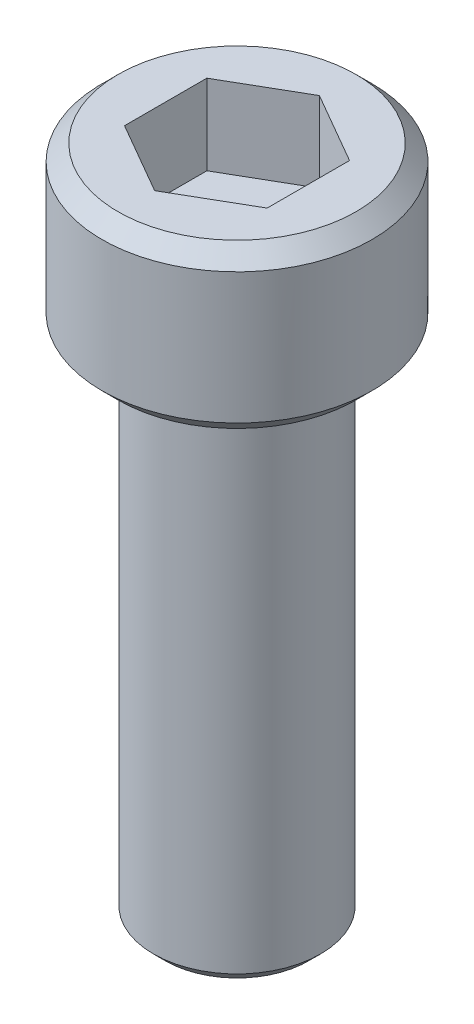
ISO-10303-21;
HEADER;
FILE_DESCRIPTION(('STEP AP214'),'2;1');
FILE_NAME('part.step','',(''),(''),'','','');
FILE_SCHEMA(('AUTOMOTIVE_DESIGN { 1 0 10303 214 1 1 1 1 }'));
ENDSEC;
DATA;
#1=APPLICATION_CONTEXT('core data for automotive mechanical design processes');
#2=APPLICATION_PROTOCOL_DEFINITION('international standard','automotive_design',2000,#1);
#3=PRODUCT_CONTEXT('',#1,'mechanical');
#4=PRODUCT('Part','Part','',(#3));
#5=PRODUCT_RELATED_PRODUCT_CATEGORY('part','',(#4));
#6=PRODUCT_DEFINITION_FORMATION('','',#4);
#7=PRODUCT_DEFINITION_CONTEXT('part definition',#1,'design');
#8=PRODUCT_DEFINITION('design','',#6,#7);
#9=PRODUCT_DEFINITION_SHAPE('','',#8);
#10=(LENGTH_UNIT() NAMED_UNIT(*) SI_UNIT(.MILLI.,.METRE.));
#11=(NAMED_UNIT(*) PLANE_ANGLE_UNIT() SI_UNIT($,.RADIAN.));
#12=(NAMED_UNIT(*) SI_UNIT($,.STERADIAN.) SOLID_ANGLE_UNIT());
#13=UNCERTAINTY_MEASURE_WITH_UNIT(LENGTH_MEASURE(1.E-05),#10,'distance_accuracy_value','');
#14=(GEOMETRIC_REPRESENTATION_CONTEXT(3) GLOBAL_UNCERTAINTY_ASSIGNED_CONTEXT((#13)) GLOBAL_UNIT_ASSIGNED_CONTEXT((#10,
#11,#12)) REPRESENTATION_CONTEXT('',''));
#15=CARTESIAN_POINT('',(0.,0.,0.));
#16=DIRECTION('',(0.,0.,1.));
#17=DIRECTION('',(1.,0.,0.));
#18=AXIS2_PLACEMENT_3D('',#15,#16,#17);
#19=CARTESIAN_POINT('',(1.778,2.064,3.07958633585746));
#20=DIRECTION('',(0.,1.,0.));
#21=DIRECTION('',(0.,0.,1.));
#22=AXIS2_PLACEMENT_3D('',#19,#20,#21);
#23=PLANE('',#22);
#24=DIRECTION('',(-0.866025403784439,0.,0.5));
#25=VECTOR('',#24,1.);
#26=CARTESIAN_POINT('',(0.,2.064,-2.05305755723831));
#27=LINE('',#26,#25);
#28=CARTESIAN_POINT('',(0.,2.064,-2.05305755723831));
#29=VERTEX_POINT('',#28);
#30=CARTESIAN_POINT('',(-1.778,2.064,-1.02652877861915));
#31=VERTEX_POINT('',#30);
#32=EDGE_CURVE('E67',#29,#31,#27,.T.);
#33=ORIENTED_EDGE('',*,*,#32,.T.);
#34=DIRECTION('',(0.,0.,1.));
#35=VECTOR('',#34,1.);
#36=CARTESIAN_POINT('',(-1.778,2.064,-1.02652877861915));
#37=LINE('',#36,#35);
#38=CARTESIAN_POINT('',(-1.778,2.064,1.02652877861916));
#39=VERTEX_POINT('',#38);
#40=EDGE_CURVE('E69',#31,#39,#37,.T.);
#41=ORIENTED_EDGE('',*,*,#40,.T.);
#42=DIRECTION('',(0.866025403784439,0.,0.499999999999999));
#43=VECTOR('',#42,1.);
#44=CARTESIAN_POINT('',(-1.778,2.064,1.02652877861916));
#45=LINE('',#44,#43);
#46=CARTESIAN_POINT('',(0.,2.064,2.05305755723831));
#47=VERTEX_POINT('',#46);
#48=EDGE_CURVE('E71',#39,#47,#45,.T.);
#49=ORIENTED_EDGE('',*,*,#48,.T.);
#50=DIRECTION('',(0.866025403784438,0.,-0.500000000000001));
#51=VECTOR('',#50,1.);
#52=CARTESIAN_POINT('',(0.,2.064,2.05305755723831));
#53=LINE('',#52,#51);
#54=CARTESIAN_POINT('',(1.778,2.064,1.02652877861915));
#55=VERTEX_POINT('',#54);
#56=EDGE_CURVE('E126',#47,#55,#53,.T.);
#57=ORIENTED_EDGE('',*,*,#56,.T.);
#58=DIRECTION('',(0.,0.,-1.));
#59=VECTOR('',#58,1.);
#60=CARTESIAN_POINT('',(1.778,2.064,1.02652877861915));
#61=LINE('',#60,#59);
#62=CARTESIAN_POINT('',(1.778,2.064,-1.02652877861916));
#63=VERTEX_POINT('',#62);
#64=EDGE_CURVE('E131',#55,#63,#61,.T.);
#65=ORIENTED_EDGE('',*,*,#64,.T.);
#66=DIRECTION('',(-0.866025403784439,0.,-0.499999999999999));
#67=VECTOR('',#66,1.);
#68=CARTESIAN_POINT('',(1.778,2.064,-1.02652877861916));
#69=LINE('',#68,#67);
#70=EDGE_CURVE('E135',#63,#29,#69,.T.);
#71=ORIENTED_EDGE('',*,*,#70,.T.);
#72=EDGE_LOOP('',(#33,#41,#49,#57,#65,#71));
#73=FACE_BOUND('',#72,.T.);
#74=ADVANCED_FACE('F16',(#73),#23,.T.);
#75=CARTESIAN_POINT('',(-1.778,2.064,1.02652877861916));
#76=DIRECTION('',(-0.499999999999999,0.,0.866025403784439));
#77=DIRECTION('',(0.866025403784439,0.,0.499999999999999));
#78=AXIS2_PLACEMENT_3D('',#75,#76,#77);
#79=PLANE('',#78);
#80=DIRECTION('',(0.,1.,0.));
#81=VECTOR('',#80,1.);
#82=CARTESIAN_POINT('',(0.,2.064,2.05305755723831));
#83=LINE('',#82,#81);
#84=CARTESIAN_POINT('',(0.,4.064,2.05305755723831));
#85=VERTEX_POINT('',#84);
#86=EDGE_CURVE('E82',#85,#47,#83,.F.);
#87=ORIENTED_EDGE('',*,*,#86,.T.);
#88=ORIENTED_EDGE('',*,*,#48,.F.);
#89=DIRECTION('',(0.,1.,0.));
#90=VECTOR('',#89,1.);
#91=CARTESIAN_POINT('',(-1.778,2.064,1.02652877861916));
#92=LINE('',#91,#90);
#93=CARTESIAN_POINT('',(-1.778,4.064,1.02652877861916));
#94=VERTEX_POINT('',#93);
#95=EDGE_CURVE('E76',#39,#94,#92,.T.);
#96=ORIENTED_EDGE('',*,*,#95,.T.);
#97=DIRECTION('',(-0.866025403784439,0.,-0.5));
#98=VECTOR('',#97,1.);
#99=CARTESIAN_POINT('',(0.,4.064,2.05305755723831));
#100=LINE('',#99,#98);
#101=EDGE_CURVE('E123',#85,#94,#100,.T.);
#102=ORIENTED_EDGE('',*,*,#101,.F.);
#103=EDGE_LOOP('',(#87,#88,#96,#102));
#104=FACE_BOUND('',#103,.T.);
#105=ADVANCED_FACE('F79',(#104),#79,.F.);
#106=CARTESIAN_POINT('',(-1.778,2.064,-1.02652877861915));
#107=DIRECTION('',(-1.,0.,0.));
#108=DIRECTION('',(0.,0.,1.));
#109=AXIS2_PLACEMENT_3D('',#106,#107,#108);
#110=PLANE('',#109);
#111=ORIENTED_EDGE('',*,*,#95,.F.);
#112=ORIENTED_EDGE('',*,*,#40,.F.);
#113=DIRECTION('',(0.,1.,0.));
#114=VECTOR('',#113,1.);
#115=CARTESIAN_POINT('',(-1.778,2.064,-1.02652877861915));
#116=LINE('',#115,#114);
#117=CARTESIAN_POINT('',(-1.778,4.064,-1.02652877861915));
#118=VERTEX_POINT('',#117);
#119=EDGE_CURVE('E90',#31,#118,#116,.T.);
#120=ORIENTED_EDGE('',*,*,#119,.T.);
#121=DIRECTION('',(0.,0.,1.));
#122=VECTOR('',#121,1.);
#123=CARTESIAN_POINT('',(-1.778,4.064,0.));
#124=LINE('',#123,#122);
#125=EDGE_CURVE('E87',#94,#118,#124,.F.);
#126=ORIENTED_EDGE('',*,*,#125,.F.);
#127=EDGE_LOOP('',(#111,#112,#120,#126));
#128=FACE_BOUND('',#127,.T.);
#129=ADVANCED_FACE('F85',(#128),#110,.F.);
#130=CARTESIAN_POINT('',(0.,2.064,-2.05305755723831));
#131=DIRECTION('',(-0.5,0.,-0.866025403784439));
#132=DIRECTION('',(-0.866025403784439,0.,0.5));
#133=AXIS2_PLACEMENT_3D('',#130,#131,#132);
#134=PLANE('',#133);
#135=ORIENTED_EDGE('',*,*,#119,.F.);
#136=ORIENTED_EDGE('',*,*,#32,.F.);
#137=DIRECTION('',(0.,1.,0.));
#138=VECTOR('',#137,1.);
#139=CARTESIAN_POINT('',(0.,2.064,-2.05305755723831));
#140=LINE('',#139,#138);
#141=CARTESIAN_POINT('',(0.,4.064,-2.05305755723831));
#142=VERTEX_POINT('',#141);
#143=EDGE_CURVE('E133',#29,#142,#140,.T.);
#144=ORIENTED_EDGE('',*,*,#143,.T.);
#145=DIRECTION('',(0.866025403784438,0.,-0.5));
#146=VECTOR('',#145,1.);
#147=CARTESIAN_POINT('',(-1.778,4.064,-1.02652877861915));
#148=LINE('',#147,#146);
#149=EDGE_CURVE('E119',#118,#142,#148,.T.);
#150=ORIENTED_EDGE('',*,*,#149,.F.);
#151=EDGE_LOOP('',(#135,#136,#144,#150));
#152=FACE_BOUND('',#151,.T.);
#153=ADVANCED_FACE('F138',(#152),#134,.F.);
#154=CARTESIAN_POINT('',(1.778,2.064,-1.02652877861916));
#155=DIRECTION('',(0.499999999999999,0.,-0.866025403784439));
#156=DIRECTION('',(-0.866025403784439,0.,-0.499999999999999));
#157=AXIS2_PLACEMENT_3D('',#154,#155,#156);
#158=PLANE('',#157);
#159=ORIENTED_EDGE('',*,*,#143,.F.);
#160=ORIENTED_EDGE('',*,*,#70,.F.);
#161=DIRECTION('',(0.,1.,0.));
#162=VECTOR('',#161,1.);
#163=CARTESIAN_POINT('',(1.778,2.064,-1.02652877861916));
#164=LINE('',#163,#162);
#165=CARTESIAN_POINT('',(1.778,4.064,-1.02652877861916));
#166=VERTEX_POINT('',#165);
#167=EDGE_CURVE('E129',#63,#166,#164,.T.);
#168=ORIENTED_EDGE('',*,*,#167,.T.);
#169=DIRECTION('',(0.866025403784439,0.,0.5));
#170=VECTOR('',#169,1.);
#171=CARTESIAN_POINT('',(0.,4.064,-2.05305755723831));
#172=LINE('',#171,#170);
#173=EDGE_CURVE('E116',#142,#166,#172,.T.);
#174=ORIENTED_EDGE('',*,*,#173,.F.);
#175=EDGE_LOOP('',(#159,#160,#168,#174));
#176=FACE_BOUND('',#175,.T.);
#177=ADVANCED_FACE('F150',(#176),#158,.F.);
#178=CARTESIAN_POINT('',(1.778,2.064,1.02652877861915));
#179=DIRECTION('',(1.,0.,0.));
#180=DIRECTION('',(0.,0.,-1.));
#181=AXIS2_PLACEMENT_3D('',#178,#179,#180);
#182=PLANE('',#181);
#183=ORIENTED_EDGE('',*,*,#167,.F.);
#184=ORIENTED_EDGE('',*,*,#64,.F.);
#185=DIRECTION('',(0.,1.,0.));
#186=VECTOR('',#185,1.);
#187=CARTESIAN_POINT('',(1.778,2.064,1.02652877861915));
#188=LINE('',#187,#186);
#189=CARTESIAN_POINT('',(1.778,4.064,1.02652877861915));
#190=VERTEX_POINT('',#189);
#191=EDGE_CURVE('E34',#55,#190,#188,.T.);
#192=ORIENTED_EDGE('',*,*,#191,.T.);
#193=DIRECTION('',(0.,0.,1.));
#194=VECTOR('',#193,1.);
#195=CARTESIAN_POINT('',(1.778,4.064,0.));
#196=LINE('',#195,#194);
#197=EDGE_CURVE('E113',#166,#190,#196,.T.);
#198=ORIENTED_EDGE('',*,*,#197,.F.);
#199=EDGE_LOOP('',(#183,#184,#192,#198));
#200=FACE_BOUND('',#199,.T.);
#201=ADVANCED_FACE('F148',(#200),#182,.F.);
#202=CARTESIAN_POINT('',(0.,2.064,2.05305755723831));
#203=DIRECTION('',(0.500000000000001,0.,0.866025403784438));
#204=DIRECTION('',(0.866025403784438,0.,-0.500000000000001));
#205=AXIS2_PLACEMENT_3D('',#202,#203,#204);
#206=PLANE('',#205);
#207=ORIENTED_EDGE('',*,*,#191,.F.);
#208=ORIENTED_EDGE('',*,*,#56,.F.);
#209=ORIENTED_EDGE('',*,*,#86,.F.);
#210=DIRECTION('',(-0.866025403784438,0.,0.500000000000001));
#211=VECTOR('',#210,1.);
#212=CARTESIAN_POINT('',(1.778,4.064,1.02652877861915));
#213=LINE('',#212,#211);
#214=EDGE_CURVE('E110',#190,#85,#213,.T.);
#215=ORIENTED_EDGE('',*,*,#214,.F.);
#216=EDGE_LOOP('',(#207,#208,#209,#215));
#217=FACE_BOUND('',#216,.T.);
#218=ADVANCED_FACE('F145',(#217),#206,.F.);
#219=CARTESIAN_POINT('',(0.,4.064,0.));
#220=DIRECTION('',(0.,1.,0.));
#221=DIRECTION('',(0.,0.,1.));
#222=AXIS2_PLACEMENT_3D('',#219,#220,#221);
#223=PLANE('',#222);
#224=ORIENTED_EDGE('',*,*,#197,.T.);
#225=ORIENTED_EDGE('',*,*,#214,.T.);
#226=ORIENTED_EDGE('',*,*,#101,.T.);
#227=ORIENTED_EDGE('',*,*,#125,.T.);
#228=ORIENTED_EDGE('',*,*,#149,.T.);
#229=ORIENTED_EDGE('',*,*,#173,.T.);
#230=EDGE_LOOP('',(#224,#225,#226,#227,#228,#229));
#231=FACE_BOUND('',#230,.T.);
#232=CARTESIAN_POINT('',(0.,4.06400000002805,0.));
#233=DIRECTION('',(0.,-1.,0.));
#234=DIRECTION('',(1.,0.,0.));
#235=AXIS2_PLACEMENT_3D('',#232,#233,#234);
#236=CIRCLE('',#235,2.96550000001616);
#237=CARTESIAN_POINT('',(2.96550000001616,4.06400000002805,0.));
#238=VERTEX_POINT('',#237);
#239=EDGE_CURVE('E19',#238,#238,#236,.T.);
#240=ORIENTED_EDGE('',*,*,#239,.F.);
#241=EDGE_LOOP('',(#240));
#242=FACE_BOUND('',#241,.T.);
#243=ADVANCED_FACE('F142',(#231,#242),#223,.T.);
#244=CARTESIAN_POINT('',(0.,3.66400000007161,0.));
#245=DIRECTION('',(0.,-1.,0.));
#246=DIRECTION('',(1.,0.,0.));
#247=AXIS2_PLACEMENT_3D('',#244,#245,#246);
#248=CONICAL_SURFACE('',#247,3.36550000002944,0.785398163468503);
#249=ORIENTED_EDGE('',*,*,#239,.T.);
#250=EDGE_LOOP('',(#249));
#251=FACE_BOUND('',#250,.T.);
#252=CARTESIAN_POINT('',(0.,3.664,0.));
#253=DIRECTION('',(0.,-1.,0.));
#254=DIRECTION('',(0.,0.,-1.));
#255=AXIS2_PLACEMENT_3D('',#252,#253,#254);
#256=CIRCLE('',#255,3.3655);
#257=CARTESIAN_POINT('',(0.,3.664,-3.3655));
#258=VERTEX_POINT('',#257);
#259=EDGE_CURVE('E102',#258,#258,#256,.T.);
#260=ORIENTED_EDGE('',*,*,#259,.F.);
#261=EDGE_LOOP('',(#260));
#262=FACE_BOUND('',#261,.T.);
#263=ADVANCED_FACE('F187',(#251,#262),#248,.T.);
#264=CARTESIAN_POINT('',(0.,4.064,0.));
#265=DIRECTION('',(0.,-1.,0.));
#266=DIRECTION('',(0.,0.,-1.));
#267=AXIS2_PLACEMENT_3D('',#264,#265,#266);
#268=CYLINDRICAL_SURFACE('',#267,3.3655);
#269=ORIENTED_EDGE('',*,*,#259,.T.);
#270=EDGE_LOOP('',(#269));
#271=FACE_BOUND('',#270,.T.);
#272=CARTESIAN_POINT('',(0.,0.400000000070122,0.));
#273=DIRECTION('',(0.,1.,0.));
#274=DIRECTION('',(0.,0.,1.));
#275=AXIS2_PLACEMENT_3D('',#272,#273,#274);
#276=CIRCLE('',#275,3.3654999999726);
#277=CARTESIAN_POINT('',(0.,0.400000000070122,3.3654999999726));
#278=VERTEX_POINT('',#277);
#279=EDGE_CURVE('E98',#278,#278,#276,.F.);
#280=ORIENTED_EDGE('',*,*,#279,.F.);
#281=EDGE_LOOP('',(#280));
#282=FACE_BOUND('',#281,.T.);
#283=ADVANCED_FACE('F183',(#271,#282),#268,.T.);
#284=CARTESIAN_POINT('',(0.,-12.7,0.));
#285=DIRECTION('',(0.,1.,0.));
#286=DIRECTION('',(0.,0.,1.));
#287=AXIS2_PLACEMENT_3D('',#284,#285,#286);
#288=PLANE('',#287);
#289=CARTESIAN_POINT('',(0.,-12.6999999999953,0.));
#290=DIRECTION('',(0.,1.,0.));
#291=DIRECTION('',(0.,0.,1.));
#292=AXIS2_PLACEMENT_3D('',#289,#290,#291);
#293=CIRCLE('',#292,1.78280000000086);
#294=CARTESIAN_POINT('',(0.,-12.6999999999953,1.78280000000086));
#295=VERTEX_POINT('',#294);
#296=EDGE_CURVE('E96',#295,#295,#293,.T.);
#297=ORIENTED_EDGE('',*,*,#296,.F.);
#298=EDGE_LOOP('',(#297));
#299=FACE_BOUND('',#298,.T.);
#300=ADVANCED_FACE('F179',(#299),#288,.F.);
#301=CARTESIAN_POINT('',(0.,0.400000000013279,0.));
#302=DIRECTION('',(0.,1.,0.));
#303=DIRECTION('',(0.,0.,1.));
#304=AXIS2_PLACEMENT_3D('',#301,#302,#303);
#305=CONICAL_SURFACE('',#304,3.36549999985891,0.785398163397448);
#306=CARTESIAN_POINT('',(0.,1.13686837721616E-10,0.));
#307=DIRECTION('',(0.,1.,0.));
#308=DIRECTION('',(0.,0.,1.));
#309=AXIS2_PLACEMENT_3D('',#306,#307,#308);
#310=CIRCLE('',#309,2.96549999995932);
#311=CARTESIAN_POINT('',(0.,1.13686837721616E-10,2.96549999995932));
#312=VERTEX_POINT('',#311);
#313=EDGE_CURVE('E94',#312,#312,#310,.T.);
#314=ORIENTED_EDGE('',*,*,#313,.T.);
#315=EDGE_LOOP('',(#314));
#316=FACE_BOUND('',#315,.T.);
#317=ORIENTED_EDGE('',*,*,#279,.T.);
#318=EDGE_LOOP('',(#317));
#319=FACE_BOUND('',#318,.T.);
#320=ADVANCED_FACE('F175',(#316,#319),#305,.T.);
#321=CARTESIAN_POINT('',(0.,-12.4000000000706,0.));
#322=DIRECTION('',(0.,1.,0.));
#323=DIRECTION('',(0.,0.,1.));
#324=AXIS2_PLACEMENT_3D('',#321,#322,#323);
#325=CONICAL_SURFACE('',#324,2.08279999992556,0.785398163397448);
#326=CARTESIAN_POINT('',(0.,-12.4,0.));
#327=DIRECTION('',(0.,1.,0.));
#328=DIRECTION('',(0.,0.,1.));
#329=AXIS2_PLACEMENT_3D('',#326,#327,#328);
#330=CIRCLE('',#329,2.0828);
#331=CARTESIAN_POINT('',(0.,-12.4,2.0828));
#332=VERTEX_POINT('',#331);
#333=EDGE_CURVE('E25',#332,#332,#330,.T.);
#334=ORIENTED_EDGE('',*,*,#333,.F.);
#335=EDGE_LOOP('',(#334));
#336=FACE_BOUND('',#335,.T.);
#337=ORIENTED_EDGE('',*,*,#296,.T.);
#338=EDGE_LOOP('',(#337));
#339=FACE_BOUND('',#338,.T.);
#340=ADVANCED_FACE('F168',(#336,#339),#325,.T.);
#341=CARTESIAN_POINT('',(0.,0.,0.));
#342=DIRECTION('',(0.,1.,0.));
#343=DIRECTION('',(0.,0.,1.));
#344=AXIS2_PLACEMENT_3D('',#341,#342,#343);
#345=PLANE('',#344);
#346=CARTESIAN_POINT('',(0.,0.,0.));
#347=DIRECTION('',(0.,1.,0.));
#348=DIRECTION('',(0.,0.,1.));
#349=AXIS2_PLACEMENT_3D('',#346,#347,#348);
#350=CIRCLE('',#349,2.0828);
#351=CARTESIAN_POINT('',(0.,0.,2.0828));
#352=VERTEX_POINT('',#351);
#353=EDGE_CURVE('E11',#352,#352,#350,.F.);
#354=ORIENTED_EDGE('',*,*,#353,.F.);
#355=EDGE_LOOP('',(#354));
#356=FACE_BOUND('',#355,.T.);
#357=ORIENTED_EDGE('',*,*,#313,.F.);
#358=EDGE_LOOP('',(#357));
#359=FACE_BOUND('',#358,.T.);
#360=ADVANCED_FACE('F162',(#356,#359),#345,.F.);
#361=CARTESIAN_POINT('',(0.,-12.7,0.));
#362=DIRECTION('',(0.,1.,0.));
#363=DIRECTION('',(0.,0.,1.));
#364=AXIS2_PLACEMENT_3D('',#361,#362,#363);
#365=CYLINDRICAL_SURFACE('',#364,2.0828);
#366=ORIENTED_EDGE('',*,*,#353,.T.);
#367=EDGE_LOOP('',(#366));
#368=FACE_BOUND('',#367,.T.);
#369=ORIENTED_EDGE('',*,*,#333,.T.);
#370=EDGE_LOOP('',(#369));
#371=FACE_BOUND('',#370,.T.);
#372=ADVANCED_FACE('F160',(#368,#371),#365,.T.);
#373=CLOSED_SHELL('',(#74,#105,#129,#153,#177,#201,#218,#243,#263,#283,#300,#320,#340,#360,#372));
#374=MANIFOLD_SOLID_BREP('B1',#373);
#375=ADVANCED_BREP_SHAPE_REPRESENTATION('',(#18,#374),#14);
#376=SHAPE_DEFINITION_REPRESENTATION(#9,#375);
ENDSEC;
END-ISO-10303-21;
